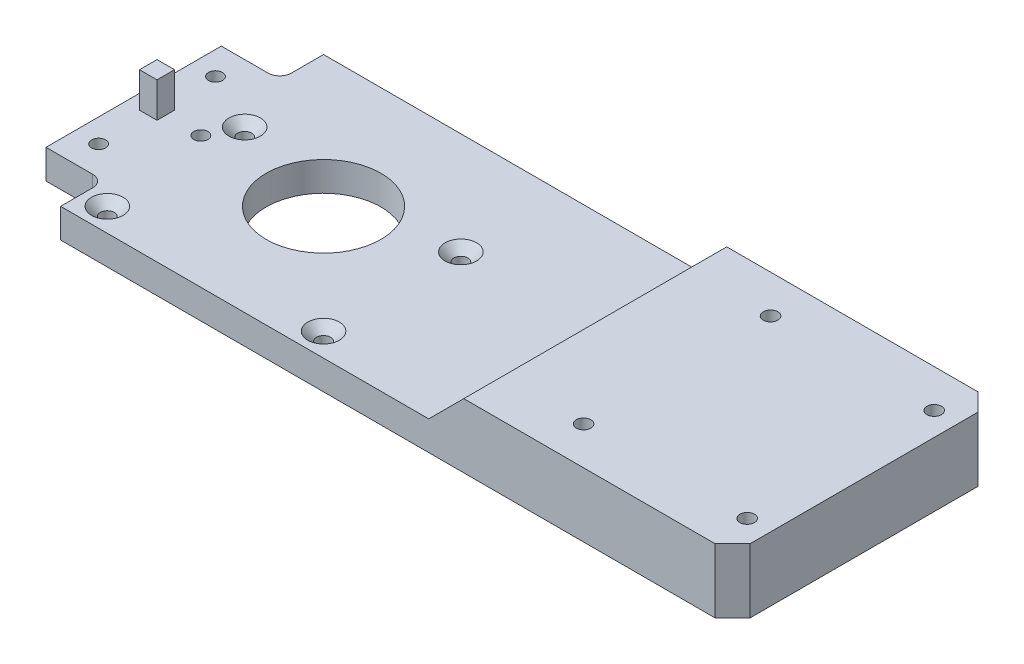
ISO-10303-21;
HEADER;
FILE_DESCRIPTION(('STEP AP214'),'2;1');
FILE_NAME('part.step','',(''),(''),'','','');
FILE_SCHEMA(('AUTOMOTIVE_DESIGN { 1 0 10303 214 1 1 1 1 }'));
ENDSEC;
DATA;
#1=APPLICATION_CONTEXT('core data for automotive mechanical design processes');
#2=APPLICATION_PROTOCOL_DEFINITION('international standard','automotive_design',2000,#1);
#3=PRODUCT_CONTEXT('',#1,'mechanical');
#4=PRODUCT('Part','Part','',(#3));
#5=PRODUCT_RELATED_PRODUCT_CATEGORY('part','',(#4));
#6=PRODUCT_DEFINITION_FORMATION('','',#4);
#7=PRODUCT_DEFINITION_CONTEXT('part definition',#1,'design');
#8=PRODUCT_DEFINITION('design','',#6,#7);
#9=PRODUCT_DEFINITION_SHAPE('','',#8);
#10=(LENGTH_UNIT() NAMED_UNIT(*) SI_UNIT(.MILLI.,.METRE.));
#11=(NAMED_UNIT(*) PLANE_ANGLE_UNIT() SI_UNIT($,.RADIAN.));
#12=(NAMED_UNIT(*) SI_UNIT($,.STERADIAN.) SOLID_ANGLE_UNIT());
#13=UNCERTAINTY_MEASURE_WITH_UNIT(LENGTH_MEASURE(1.E-05),#10,'distance_accuracy_value','');
#14=(GEOMETRIC_REPRESENTATION_CONTEXT(3) GLOBAL_UNCERTAINTY_ASSIGNED_CONTEXT((#13)) GLOBAL_UNIT_ASSIGNED_CONTEXT((#10,
#11,#12)) REPRESENTATION_CONTEXT('',''));
#15=CARTESIAN_POINT('',(0.,0.,0.));
#16=DIRECTION('',(0.,0.,1.));
#17=DIRECTION('',(1.,0.,0.));
#18=AXIS2_PLACEMENT_3D('',#15,#16,#17);
#19=CARTESIAN_POINT('',(0.,5.,0.));
#20=DIRECTION('',(0.,1.,0.));
#21=DIRECTION('',(0.,0.,1.));
#22=AXIS2_PLACEMENT_3D('',#19,#20,#21);
#23=PLANE('',#22);
#24=CARTESIAN_POINT('',(1.5,5.,0.));
#25=DIRECTION('',(0.,-1.,0.));
#26=DIRECTION('',(0.,0.,-1.));
#27=AXIS2_PLACEMENT_3D('',#24,#25,#26);
#28=CIRCLE('',#27,1.19999999999999);
#29=CARTESIAN_POINT('',(1.5,5.,-1.19999999999999));
#30=VERTEX_POINT('',#29);
#31=EDGE_CURVE('E200',#30,#30,#28,.T.);
#32=ORIENTED_EDGE('',*,*,#31,.T.);
#33=EDGE_LOOP('',(#32));
#34=FACE_BOUND('',#33,.T.);
#35=CARTESIAN_POINT('',(-6.,5.,10.));
#36=DIRECTION('',(0.,-1.,0.));
#37=DIRECTION('',(0.,0.,-1.));
#38=AXIS2_PLACEMENT_3D('',#35,#36,#37);
#39=CIRCLE('',#38,1.19999999999999);
#40=CARTESIAN_POINT('',(-6.,5.,8.80000000000001));
#41=VERTEX_POINT('',#40);
#42=EDGE_CURVE('E209',#41,#41,#39,.T.);
#43=ORIENTED_EDGE('',*,*,#42,.T.);
#44=EDGE_LOOP('',(#43));
#45=FACE_BOUND('',#44,.T.);
#46=CARTESIAN_POINT('',(-6.,5.,-10.));
#47=DIRECTION('',(0.,-1.,0.));
#48=DIRECTION('',(0.,0.,-1.));
#49=AXIS2_PLACEMENT_3D('',#46,#47,#48);
#50=CIRCLE('',#49,1.19999999999999);
#51=CARTESIAN_POINT('',(-6.,5.,-11.2));
#52=VERTEX_POINT('',#51);
#53=EDGE_CURVE('E218',#52,#52,#50,.T.);
#54=ORIENTED_EDGE('',*,*,#53,.T.);
#55=EDGE_LOOP('',(#54));
#56=FACE_BOUND('',#55,.T.);
#57=DIRECTION('',(0.,0.,1.));
#58=VECTOR('',#57,1.);
#59=CARTESIAN_POINT('',(63.,5.,-22.5));
#60=LINE('',#59,#58);
#61=CARTESIAN_POINT('',(63.,5.,-22.5));
#62=VERTEX_POINT('',#61);
#63=CARTESIAN_POINT('',(63.,5.,22.5));
#64=VERTEX_POINT('',#63);
#65=EDGE_CURVE('E266',#62,#64,#60,.T.);
#66=ORIENTED_EDGE('',*,*,#65,.F.);
#67=DIRECTION('',(1.,0.,0.));
#68=VECTOR('',#67,1.);
#69=CARTESIAN_POINT('',(0.,5.,-22.5));
#70=LINE('',#69,#68);
#71=CARTESIAN_POINT('',(0.,5.,-22.5));
#72=VERTEX_POINT('',#71);
#73=EDGE_CURVE('E323',#72,#62,#70,.T.);
#74=ORIENTED_EDGE('',*,*,#73,.F.);
#75=DIRECTION('',(0.,0.,-1.));
#76=VECTOR('',#75,1.);
#77=CARTESIAN_POINT('',(0.,5.,22.5));
#78=LINE('',#77,#76);
#79=CARTESIAN_POINT('',(0.,5.,-17.));
#80=VERTEX_POINT('',#79);
#81=EDGE_CURVE('E327',#80,#72,#78,.T.);
#82=ORIENTED_EDGE('',*,*,#81,.F.);
#83=CARTESIAN_POINT('',(-2.,5.,-17.));
#84=DIRECTION('',(0.,1.,0.));
#85=DIRECTION('',(0.,0.,1.));
#86=AXIS2_PLACEMENT_3D('',#83,#84,#85);
#87=CIRCLE('',#86,2.);
#88=CARTESIAN_POINT('',(-2.,5.,-15.));
#89=VERTEX_POINT('',#88);
#90=EDGE_CURVE('E11',#80,#89,#87,.F.);
#91=ORIENTED_EDGE('',*,*,#90,.T.);
#92=DIRECTION('',(-1.,0.,0.));
#93=VECTOR('',#92,1.);
#94=CARTESIAN_POINT('',(-10.,5.,-15.));
#95=LINE('',#94,#93);
#96=CARTESIAN_POINT('',(-10.,5.,-15.));
#97=VERTEX_POINT('',#96);
#98=EDGE_CURVE('E225',#89,#97,#95,.T.);
#99=ORIENTED_EDGE('',*,*,#98,.T.);
#100=DIRECTION('',(0.,0.,1.));
#101=VECTOR('',#100,1.);
#102=CARTESIAN_POINT('',(-10.,5.,15.));
#103=LINE('',#102,#101);
#104=CARTESIAN_POINT('',(-10.,5.,15.));
#105=VERTEX_POINT('',#104);
#106=EDGE_CURVE('E236',#97,#105,#103,.T.);
#107=ORIENTED_EDGE('',*,*,#106,.T.);
#108=DIRECTION('',(1.,0.,0.));
#109=VECTOR('',#108,1.);
#110=CARTESIAN_POINT('',(0.,5.,15.));
#111=LINE('',#110,#109);
#112=CARTESIAN_POINT('',(-2.,5.,15.));
#113=VERTEX_POINT('',#112);
#114=EDGE_CURVE('E232',#105,#113,#111,.T.);
#115=ORIENTED_EDGE('',*,*,#114,.T.);
#116=CARTESIAN_POINT('',(-2.,5.,17.));
#117=DIRECTION('',(0.,1.,0.));
#118=DIRECTION('',(0.,0.,1.));
#119=AXIS2_PLACEMENT_3D('',#116,#117,#118);
#120=CIRCLE('',#119,2.);
#121=CARTESIAN_POINT('',(0.,5.,17.));
#122=VERTEX_POINT('',#121);
#123=EDGE_CURVE('E385',#113,#122,#120,.F.);
#124=ORIENTED_EDGE('',*,*,#123,.T.);
#125=CARTESIAN_POINT('',(0.,5.,22.5));
#126=VERTEX_POINT('',#125);
#127=EDGE_CURVE('E328',#126,#122,#78,.T.);
#128=ORIENTED_EDGE('',*,*,#127,.F.);
#129=DIRECTION('',(1.,0.,0.));
#130=VECTOR('',#129,1.);
#131=CARTESIAN_POINT('',(0.,5.,22.5));
#132=LINE('',#131,#130);
#133=EDGE_CURVE('E320',#126,#64,#132,.T.);
#134=ORIENTED_EDGE('',*,*,#133,.T.);
#135=EDGE_LOOP('',(#66,#74,#82,#91,#99,#107,#115,#124,#128,#134));
#136=FACE_BOUND('',#135,.T.);
#137=CARTESIAN_POINT('',(4.,5.,18.5));
#138=DIRECTION('',(0.,1.,0.));
#139=DIRECTION('',(0.,0.,1.));
#140=AXIS2_PLACEMENT_3D('',#137,#138,#139);
#141=CIRCLE('',#140,2.7);
#142=CARTESIAN_POINT('',(4.,5.,21.2));
#143=VERTEX_POINT('',#142);
#144=EDGE_CURVE('E275',#143,#143,#141,.T.);
#145=ORIENTED_EDGE('',*,*,#144,.F.);
#146=EDGE_LOOP('',(#145));
#147=FACE_BOUND('',#146,.T.);
#148=CARTESIAN_POINT('',(41.,5.,18.5));
#149=DIRECTION('',(0.,1.,0.));
#150=DIRECTION('',(0.,0.,1.));
#151=AXIS2_PLACEMENT_3D('',#148,#149,#150);
#152=CIRCLE('',#151,2.7);
#153=CARTESIAN_POINT('',(41.,5.,21.2));
#154=VERTEX_POINT('',#153);
#155=EDGE_CURVE('E286',#154,#154,#152,.T.);
#156=ORIENTED_EDGE('',*,*,#155,.F.);
#157=EDGE_LOOP('',(#156));
#158=FACE_BOUND('',#157,.T.);
#159=CARTESIAN_POINT('',(41.,5.,-5.));
#160=DIRECTION('',(0.,1.,0.));
#161=DIRECTION('',(0.,0.,1.));
#162=AXIS2_PLACEMENT_3D('',#159,#160,#161);
#163=CIRCLE('',#162,2.7);
#164=CARTESIAN_POINT('',(41.,5.,-2.3));
#165=VERTEX_POINT('',#164);
#166=EDGE_CURVE('E295',#165,#165,#163,.T.);
#167=ORIENTED_EDGE('',*,*,#166,.F.);
#168=EDGE_LOOP('',(#167));
#169=FACE_BOUND('',#168,.T.);
#170=CARTESIAN_POINT('',(4.,5.,-5.));
#171=DIRECTION('',(0.,1.,0.));
#172=DIRECTION('',(0.,0.,1.));
#173=AXIS2_PLACEMENT_3D('',#170,#171,#172);
#174=CIRCLE('',#173,2.7);
#175=CARTESIAN_POINT('',(4.,5.,-2.3));
#176=VERTEX_POINT('',#175);
#177=EDGE_CURVE('E304',#176,#176,#174,.T.);
#178=ORIENTED_EDGE('',*,*,#177,.F.);
#179=EDGE_LOOP('',(#178));
#180=FACE_BOUND('',#179,.T.);
#181=CARTESIAN_POINT('',(22.5,5.,0.));
#182=DIRECTION('',(0.,1.,0.));
#183=DIRECTION('',(0.,0.,1.));
#184=AXIS2_PLACEMENT_3D('',#181,#182,#183);
#185=CIRCLE('',#184,9.81710000000001);
#186=CARTESIAN_POINT('',(22.5,5.,9.81710000000001));
#187=VERTEX_POINT('',#186);
#188=EDGE_CURVE('E313',#187,#187,#185,.T.);
#189=ORIENTED_EDGE('',*,*,#188,.F.);
#190=EDGE_LOOP('',(#189));
#191=FACE_BOUND('',#190,.T.);
#192=DIRECTION('',(0.,0.,1.));
#193=VECTOR('',#192,1.);
#194=CARTESIAN_POINT('',(-7.5,5.,-1.5));
#195=LINE('',#194,#193);
#196=CARTESIAN_POINT('',(-7.5,5.,-1.5));
#197=VERTEX_POINT('',#196);
#198=CARTESIAN_POINT('',(-7.5,5.,1.5));
#199=VERTEX_POINT('',#198);
#200=EDGE_CURVE('E174',#197,#199,#195,.T.);
#201=ORIENTED_EDGE('',*,*,#200,.F.);
#202=DIRECTION('',(-1.,0.,0.));
#203=VECTOR('',#202,1.);
#204=CARTESIAN_POINT('',(-7.5,5.,-1.5));
#205=LINE('',#204,#203);
#206=CARTESIAN_POINT('',(-4.5,5.,-1.5));
#207=VERTEX_POINT('',#206);
#208=EDGE_CURVE('E50',#207,#197,#205,.T.);
#209=ORIENTED_EDGE('',*,*,#208,.F.);
#210=DIRECTION('',(0.,0.,-1.));
#211=VECTOR('',#210,1.);
#212=CARTESIAN_POINT('',(-4.5,5.,-1.5));
#213=LINE('',#212,#211);
#214=CARTESIAN_POINT('',(-4.5,5.,1.5));
#215=VERTEX_POINT('',#214);
#216=EDGE_CURVE('E180',#215,#207,#213,.T.);
#217=ORIENTED_EDGE('',*,*,#216,.F.);
#218=DIRECTION('',(1.,0.,0.));
#219=VECTOR('',#218,1.);
#220=CARTESIAN_POINT('',(-7.5,5.,1.5));
#221=LINE('',#220,#219);
#222=EDGE_CURVE('E165',#199,#215,#221,.T.);
#223=ORIENTED_EDGE('',*,*,#222,.F.);
#224=EDGE_LOOP('',(#201,#209,#217,#223));
#225=FACE_BOUND('',#224,.T.);
#226=ADVANCED_FACE('F35',(#34,#45,#56,#136,#147,#158,#169,#180,#191,#225),#23,.T.);
#227=CARTESIAN_POINT('',(0.,5.,22.5));
#228=DIRECTION('',(-1.,0.,0.));
#229=DIRECTION('',(0.,0.,1.));
#230=AXIS2_PLACEMENT_3D('',#227,#228,#229);
#231=PLANE('',#230);
#232=ORIENTED_EDGE('',*,*,#127,.T.);
#233=DIRECTION('',(0.,-1.,0.));
#234=VECTOR('',#233,1.);
#235=CARTESIAN_POINT('',(0.,5.,17.));
#236=LINE('',#235,#234);
#237=CARTESIAN_POINT('',(0.,0.,17.));
#238=VERTEX_POINT('',#237);
#239=EDGE_CURVE('E373',#122,#238,#236,.T.);
#240=ORIENTED_EDGE('',*,*,#239,.T.);
#241=DIRECTION('',(0.,0.,-1.));
#242=VECTOR('',#241,1.);
#243=CARTESIAN_POINT('',(0.,0.,22.5));
#244=LINE('',#243,#242);
#245=CARTESIAN_POINT('',(0.,0.,22.5));
#246=VERTEX_POINT('',#245);
#247=EDGE_CURVE('E324',#246,#238,#244,.T.);
#248=ORIENTED_EDGE('',*,*,#247,.F.);
#249=DIRECTION('',(0.,-1.,0.));
#250=VECTOR('',#249,1.);
#251=CARTESIAN_POINT('',(0.,5.,22.5));
#252=LINE('',#251,#250);
#253=EDGE_CURVE('E331',#126,#246,#252,.T.);
#254=ORIENTED_EDGE('',*,*,#253,.F.);
#255=EDGE_LOOP('',(#232,#240,#248,#254));
#256=FACE_BOUND('',#255,.T.);
#257=ADVANCED_FACE('F394',(#256),#231,.T.);
#258=CARTESIAN_POINT('',(0.,5.,22.5));
#259=DIRECTION('',(0.,0.,-1.));
#260=DIRECTION('',(-1.,0.,0.));
#261=AXIS2_PLACEMENT_3D('',#258,#259,#260);
#262=PLANE('',#261);
#263=DIRECTION('',(1.,0.,0.));
#264=VECTOR('',#263,1.);
#265=CARTESIAN_POINT('',(0.,0.,22.5));
#266=LINE('',#265,#264);
#267=CARTESIAN_POINT('',(112.,0.,22.5));
#268=VERTEX_POINT('',#267);
#269=EDGE_CURVE('E319',#246,#268,#266,.T.);
#270=ORIENTED_EDGE('',*,*,#269,.T.);
#271=DIRECTION('',(0.,1.,0.));
#272=VECTOR('',#271,1.);
#273=CARTESIAN_POINT('',(112.,5.,22.5));
#274=LINE('',#273,#272);
#275=CARTESIAN_POINT('',(112.,11.,22.5));
#276=VERTEX_POINT('',#275);
#277=EDGE_CURVE('E371',#268,#276,#274,.T.);
#278=ORIENTED_EDGE('',*,*,#277,.T.);
#279=DIRECTION('',(1.,0.,0.));
#280=VECTOR('',#279,1.);
#281=CARTESIAN_POINT('',(115.,11.,22.5));
#282=LINE('',#281,#280);
#283=CARTESIAN_POINT('',(69.,11.,22.5));
#284=VERTEX_POINT('',#283);
#285=EDGE_CURVE('E272',#284,#276,#282,.T.);
#286=ORIENTED_EDGE('',*,*,#285,.F.);
#287=DIRECTION('',(0.707106781186546,0.707106781186549,0.));
#288=VECTOR('',#287,1.);
#289=CARTESIAN_POINT('',(69.,11.,22.5));
#290=LINE('',#289,#288);
#291=EDGE_CURVE('E350',#284,#64,#290,.F.);
#292=ORIENTED_EDGE('',*,*,#291,.T.);
#293=ORIENTED_EDGE('',*,*,#133,.F.);
#294=ORIENTED_EDGE('',*,*,#253,.T.);
#295=EDGE_LOOP('',(#270,#278,#286,#292,#293,#294));
#296=FACE_BOUND('',#295,.T.);
#297=ADVANCED_FACE('F434',(#296),#262,.F.);
#298=CARTESIAN_POINT('',(115.,5.,22.5));
#299=DIRECTION('',(-1.,0.,0.));
#300=DIRECTION('',(0.,0.,1.));
#301=AXIS2_PLACEMENT_3D('',#298,#299,#300);
#302=PLANE('',#301);
#303=DIRECTION('',(0.,0.,-1.));
#304=VECTOR('',#303,1.);
#305=CARTESIAN_POINT('',(115.,0.,22.5));
#306=LINE('',#305,#304);
#307=CARTESIAN_POINT('',(115.,0.,19.5));
#308=VERTEX_POINT('',#307);
#309=CARTESIAN_POINT('',(115.,0.,-19.5));
#310=VERTEX_POINT('',#309);
#311=EDGE_CURVE('E334',#308,#310,#306,.T.);
#312=ORIENTED_EDGE('',*,*,#311,.T.);
#313=DIRECTION('',(0.,1.,0.));
#314=VECTOR('',#313,1.);
#315=CARTESIAN_POINT('',(115.,11.,-19.5));
#316=LINE('',#315,#314);
#317=CARTESIAN_POINT('',(115.,11.,-19.5));
#318=VERTEX_POINT('',#317);
#319=EDGE_CURVE('E365',#310,#318,#316,.T.);
#320=ORIENTED_EDGE('',*,*,#319,.T.);
#321=DIRECTION('',(0.,0.,-1.));
#322=VECTOR('',#321,1.);
#323=CARTESIAN_POINT('',(115.,11.,-22.5));
#324=LINE('',#323,#322);
#325=CARTESIAN_POINT('',(115.,11.,19.5));
#326=VERTEX_POINT('',#325);
#327=EDGE_CURVE('E267',#326,#318,#324,.T.);
#328=ORIENTED_EDGE('',*,*,#327,.F.);
#329=DIRECTION('',(0.,-1.,0.));
#330=VECTOR('',#329,1.);
#331=CARTESIAN_POINT('',(115.,5.,19.5));
#332=LINE('',#331,#330);
#333=EDGE_CURVE('E362',#326,#308,#332,.T.);
#334=ORIENTED_EDGE('',*,*,#333,.T.);
#335=EDGE_LOOP('',(#312,#320,#328,#334));
#336=FACE_BOUND('',#335,.T.);
#337=ADVANCED_FACE('F442',(#336),#302,.F.);
#338=CARTESIAN_POINT('',(0.,5.,-22.5));
#339=DIRECTION('',(0.,0.,-1.));
#340=DIRECTION('',(-1.,0.,0.));
#341=AXIS2_PLACEMENT_3D('',#338,#339,#340);
#342=PLANE('',#341);
#343=DIRECTION('',(-1.,0.,0.));
#344=VECTOR('',#343,1.);
#345=CARTESIAN_POINT('',(115.,11.,-22.5));
#346=LINE('',#345,#344);
#347=CARTESIAN_POINT('',(112.,11.,-22.5));
#348=VERTEX_POINT('',#347);
#349=CARTESIAN_POINT('',(69.,11.,-22.5));
#350=VERTEX_POINT('',#349);
#351=EDGE_CURVE('E270',#348,#350,#346,.T.);
#352=ORIENTED_EDGE('',*,*,#351,.F.);
#353=DIRECTION('',(0.,-1.,0.));
#354=VECTOR('',#353,1.);
#355=CARTESIAN_POINT('',(112.,0.,-22.5));
#356=LINE('',#355,#354);
#357=CARTESIAN_POINT('',(112.,0.,-22.5));
#358=VERTEX_POINT('',#357);
#359=EDGE_CURVE('E355',#348,#358,#356,.T.);
#360=ORIENTED_EDGE('',*,*,#359,.T.);
#361=DIRECTION('',(1.,0.,0.));
#362=VECTOR('',#361,1.);
#363=CARTESIAN_POINT('',(0.,0.,-22.5));
#364=LINE('',#363,#362);
#365=CARTESIAN_POINT('',(0.,0.,-22.5));
#366=VERTEX_POINT('',#365);
#367=EDGE_CURVE('E337',#366,#358,#364,.T.);
#368=ORIENTED_EDGE('',*,*,#367,.F.);
#369=DIRECTION('',(0.,-1.,0.));
#370=VECTOR('',#369,1.);
#371=CARTESIAN_POINT('',(0.,5.,-22.5));
#372=LINE('',#371,#370);
#373=EDGE_CURVE('E344',#72,#366,#372,.T.);
#374=ORIENTED_EDGE('',*,*,#373,.F.);
#375=ORIENTED_EDGE('',*,*,#73,.T.);
#376=DIRECTION('',(-0.707106781186546,-0.707106781186549,0.));
#377=VECTOR('',#376,1.);
#378=CARTESIAN_POINT('',(31.5000000000002,-26.5,-22.5));
#379=LINE('',#378,#377);
#380=EDGE_CURVE('E352',#62,#350,#379,.F.);
#381=ORIENTED_EDGE('',*,*,#380,.T.);
#382=EDGE_LOOP('',(#352,#360,#368,#374,#375,#381));
#383=FACE_BOUND('',#382,.T.);
#384=ADVANCED_FACE('F424',(#383),#342,.T.);
#385=CARTESIAN_POINT('',(0.,0.,-17.));
#386=VERTEX_POINT('',#385);
#387=EDGE_CURVE('E340',#386,#366,#244,.T.);
#388=ORIENTED_EDGE('',*,*,#387,.F.);
#389=DIRECTION('',(0.,-1.,0.));
#390=VECTOR('',#389,1.);
#391=CARTESIAN_POINT('',(0.,5.,-17.));
#392=LINE('',#391,#390);
#393=EDGE_CURVE('E381',#386,#80,#392,.F.);
#394=ORIENTED_EDGE('',*,*,#393,.T.);
#395=ORIENTED_EDGE('',*,*,#81,.T.);
#396=ORIENTED_EDGE('',*,*,#373,.T.);
#397=EDGE_LOOP('',(#388,#394,#395,#396));
#398=FACE_BOUND('',#397,.T.);
#399=ADVANCED_FACE('F418',(#398),#231,.T.);
#400=CARTESIAN_POINT('',(0.,0.,0.));
#401=DIRECTION('',(0.,1.,0.));
#402=DIRECTION('',(0.,0.,1.));
#403=AXIS2_PLACEMENT_3D('',#400,#401,#402);
#404=PLANE('',#403);
#405=CARTESIAN_POINT('',(1.5,0.,0.));
#406=DIRECTION('',(0.,-1.,0.));
#407=DIRECTION('',(0.,0.,-1.));
#408=AXIS2_PLACEMENT_3D('',#405,#406,#407);
#409=CIRCLE('',#408,2.7);
#410=CARTESIAN_POINT('',(1.5,0.,-2.7));
#411=VERTEX_POINT('',#410);
#412=EDGE_CURVE('E193',#411,#411,#409,.T.);
#413=ORIENTED_EDGE('',*,*,#412,.F.);
#414=EDGE_LOOP('',(#413));
#415=FACE_BOUND('',#414,.T.);
#416=CARTESIAN_POINT('',(-6.,0.,10.));
#417=DIRECTION('',(0.,-1.,0.));
#418=DIRECTION('',(0.,0.,-1.));
#419=AXIS2_PLACEMENT_3D('',#416,#417,#418);
#420=CIRCLE('',#419,2.7);
#421=CARTESIAN_POINT('',(-6.,0.,7.3));
#422=VERTEX_POINT('',#421);
#423=EDGE_CURVE('E203',#422,#422,#420,.T.);
#424=ORIENTED_EDGE('',*,*,#423,.F.);
#425=EDGE_LOOP('',(#424));
#426=FACE_BOUND('',#425,.T.);
#427=CARTESIAN_POINT('',(-6.,0.,-10.));
#428=DIRECTION('',(0.,-1.,0.));
#429=DIRECTION('',(0.,0.,-1.));
#430=AXIS2_PLACEMENT_3D('',#427,#428,#429);
#431=CIRCLE('',#430,2.7);
#432=CARTESIAN_POINT('',(-6.,0.,-12.7));
#433=VERTEX_POINT('',#432);
#434=EDGE_CURVE('E212',#433,#433,#431,.T.);
#435=ORIENTED_EDGE('',*,*,#434,.F.);
#436=EDGE_LOOP('',(#435));
#437=FACE_BOUND('',#436,.T.);
#438=CARTESIAN_POINT('',(83.,0.,-16.));
#439=DIRECTION('',(0.,1.,0.));
#440=DIRECTION('',(0.,0.,1.));
#441=AXIS2_PLACEMENT_3D('',#438,#439,#440);
#442=CIRCLE('',#441,1.25);
#443=CARTESIAN_POINT('',(83.,0.,-14.75));
#444=VERTEX_POINT('',#443);
#445=EDGE_CURVE('E245',#444,#444,#442,.T.);
#446=ORIENTED_EDGE('',*,*,#445,.T.);
#447=EDGE_LOOP('',(#446));
#448=FACE_BOUND('',#447,.T.);
#449=CARTESIAN_POINT('',(111.,0.,-16.));
#450=DIRECTION('',(0.,1.,0.));
#451=DIRECTION('',(0.,0.,1.));
#452=AXIS2_PLACEMENT_3D('',#449,#450,#451);
#453=CIRCLE('',#452,1.25);
#454=CARTESIAN_POINT('',(111.,0.,-14.75));
#455=VERTEX_POINT('',#454);
#456=EDGE_CURVE('E251',#455,#455,#453,.T.);
#457=ORIENTED_EDGE('',*,*,#456,.T.);
#458=EDGE_LOOP('',(#457));
#459=FACE_BOUND('',#458,.T.);
#460=CARTESIAN_POINT('',(83.,0.,16.));
#461=DIRECTION('',(0.,1.,0.));
#462=DIRECTION('',(0.,0.,1.));
#463=AXIS2_PLACEMENT_3D('',#460,#461,#462);
#464=CIRCLE('',#463,1.25);
#465=CARTESIAN_POINT('',(83.,0.,17.25));
#466=VERTEX_POINT('',#465);
#467=EDGE_CURVE('E257',#466,#466,#464,.T.);
#468=ORIENTED_EDGE('',*,*,#467,.T.);
#469=EDGE_LOOP('',(#468));
#470=FACE_BOUND('',#469,.T.);
#471=CARTESIAN_POINT('',(111.,0.,16.));
#472=DIRECTION('',(0.,1.,0.));
#473=DIRECTION('',(0.,0.,1.));
#474=AXIS2_PLACEMENT_3D('',#471,#472,#473);
#475=CIRCLE('',#474,1.25);
#476=CARTESIAN_POINT('',(111.,0.,17.25));
#477=VERTEX_POINT('',#476);
#478=EDGE_CURVE('E263',#477,#477,#475,.T.);
#479=ORIENTED_EDGE('',*,*,#478,.T.);
#480=EDGE_LOOP('',(#479));
#481=FACE_BOUND('',#480,.T.);
#482=CARTESIAN_POINT('',(4.,0.,18.5));
#483=DIRECTION('',(0.,1.,0.));
#484=DIRECTION('',(0.,0.,1.));
#485=AXIS2_PLACEMENT_3D('',#482,#483,#484);
#486=CIRCLE('',#485,1.19999999999999);
#487=CARTESIAN_POINT('',(4.,0.,19.7));
#488=VERTEX_POINT('',#487);
#489=EDGE_CURVE('E283',#488,#488,#486,.T.);
#490=ORIENTED_EDGE('',*,*,#489,.T.);
#491=EDGE_LOOP('',(#490));
#492=FACE_BOUND('',#491,.T.);
#493=CARTESIAN_POINT('',(41.,0.,18.5));
#494=DIRECTION('',(0.,1.,0.));
#495=DIRECTION('',(0.,0.,1.));
#496=AXIS2_PLACEMENT_3D('',#493,#494,#495);
#497=CIRCLE('',#496,1.19999999999999);
#498=CARTESIAN_POINT('',(41.,0.,19.7));
#499=VERTEX_POINT('',#498);
#500=EDGE_CURVE('E292',#499,#499,#497,.T.);
#501=ORIENTED_EDGE('',*,*,#500,.T.);
#502=EDGE_LOOP('',(#501));
#503=FACE_BOUND('',#502,.T.);
#504=CARTESIAN_POINT('',(41.,0.,-5.));
#505=DIRECTION('',(0.,1.,0.));
#506=DIRECTION('',(0.,0.,1.));
#507=AXIS2_PLACEMENT_3D('',#504,#505,#506);
#508=CIRCLE('',#507,1.19999999999999);
#509=CARTESIAN_POINT('',(41.,0.,-3.80000000000002));
#510=VERTEX_POINT('',#509);
#511=EDGE_CURVE('E301',#510,#510,#508,.T.);
#512=ORIENTED_EDGE('',*,*,#511,.T.);
#513=EDGE_LOOP('',(#512));
#514=FACE_BOUND('',#513,.T.);
#515=CARTESIAN_POINT('',(4.,0.,-5.));
#516=DIRECTION('',(0.,1.,0.));
#517=DIRECTION('',(0.,0.,1.));
#518=AXIS2_PLACEMENT_3D('',#515,#516,#517);
#519=CIRCLE('',#518,1.19999999999999);
#520=CARTESIAN_POINT('',(4.,0.,-3.80000000000001));
#521=VERTEX_POINT('',#520);
#522=EDGE_CURVE('E310',#521,#521,#519,.T.);
#523=ORIENTED_EDGE('',*,*,#522,.T.);
#524=EDGE_LOOP('',(#523));
#525=FACE_BOUND('',#524,.T.);
#526=CARTESIAN_POINT('',(22.5,0.,0.));
#527=DIRECTION('',(0.,1.,0.));
#528=DIRECTION('',(0.,0.,1.));
#529=AXIS2_PLACEMENT_3D('',#526,#527,#528);
#530=CIRCLE('',#529,9.81710000000001);
#531=CARTESIAN_POINT('',(22.5,0.,9.81710000000001));
#532=VERTEX_POINT('',#531);
#533=EDGE_CURVE('E316',#532,#532,#530,.F.);
#534=ORIENTED_EDGE('',*,*,#533,.F.);
#535=EDGE_LOOP('',(#534));
#536=FACE_BOUND('',#535,.T.);
#537=ORIENTED_EDGE('',*,*,#367,.T.);
#538=DIRECTION('',(0.707106781186546,0.,0.707106781186549));
#539=VECTOR('',#538,1.);
#540=CARTESIAN_POINT('',(112.,0.,-22.5));
#541=LINE('',#540,#539);
#542=EDGE_CURVE('E360',#358,#310,#541,.T.);
#543=ORIENTED_EDGE('',*,*,#542,.T.);
#544=ORIENTED_EDGE('',*,*,#311,.F.);
#545=DIRECTION('',(0.707106781186549,0.,-0.707106781186546));
#546=VECTOR('',#545,1.);
#547=CARTESIAN_POINT('',(115.,0.,19.5));
#548=LINE('',#547,#546);
#549=EDGE_CURVE('E358',#308,#268,#548,.F.);
#550=ORIENTED_EDGE('',*,*,#549,.T.);
#551=ORIENTED_EDGE('',*,*,#269,.F.);
#552=ORIENTED_EDGE('',*,*,#247,.T.);
#553=CARTESIAN_POINT('',(-2.,0.,17.));
#554=DIRECTION('',(0.,1.,0.));
#555=DIRECTION('',(0.,0.,1.));
#556=AXIS2_PLACEMENT_3D('',#553,#554,#555);
#557=CIRCLE('',#556,2.);
#558=CARTESIAN_POINT('',(-2.,0.,15.));
#559=VERTEX_POINT('',#558);
#560=EDGE_CURVE('E383',#238,#559,#557,.T.);
#561=ORIENTED_EDGE('',*,*,#560,.T.);
#562=DIRECTION('',(1.,0.,0.));
#563=VECTOR('',#562,1.);
#564=CARTESIAN_POINT('',(0.,0.,15.));
#565=LINE('',#564,#563);
#566=CARTESIAN_POINT('',(-10.,0.,15.));
#567=VERTEX_POINT('',#566);
#568=EDGE_CURVE('E222',#567,#559,#565,.T.);
#569=ORIENTED_EDGE('',*,*,#568,.F.);
#570=DIRECTION('',(0.,0.,1.));
#571=VECTOR('',#570,1.);
#572=CARTESIAN_POINT('',(-10.,0.,15.));
#573=LINE('',#572,#571);
#574=CARTESIAN_POINT('',(-10.,0.,-15.));
#575=VERTEX_POINT('',#574);
#576=EDGE_CURVE('E227',#575,#567,#573,.T.);
#577=ORIENTED_EDGE('',*,*,#576,.F.);
#578=DIRECTION('',(-1.,0.,0.));
#579=VECTOR('',#578,1.);
#580=CARTESIAN_POINT('',(-10.,0.,-15.));
#581=LINE('',#580,#579);
#582=CARTESIAN_POINT('',(-2.,0.,-15.));
#583=VERTEX_POINT('',#582);
#584=EDGE_CURVE('E221',#583,#575,#581,.T.);
#585=ORIENTED_EDGE('',*,*,#584,.F.);
#586=CARTESIAN_POINT('',(-2.,0.,-17.));
#587=DIRECTION('',(0.,1.,0.));
#588=DIRECTION('',(0.,0.,1.));
#589=AXIS2_PLACEMENT_3D('',#586,#587,#588);
#590=CIRCLE('',#589,2.);
#591=EDGE_CURVE('E43',#583,#386,#590,.T.);
#592=ORIENTED_EDGE('',*,*,#591,.T.);
#593=ORIENTED_EDGE('',*,*,#387,.T.);
#594=EDGE_LOOP('',(#537,#543,#544,#550,#551,#552,#561,#569,#577,#585,#592,#593));
#595=FACE_BOUND('',#594,.T.);
#596=ADVANCED_FACE('F399',(#415,#426,#437,#448,#459,#470,#481,#492,#503,#514,#525,#536,#595),
#404,.F.);
#597=CARTESIAN_POINT('',(22.5,-0.00100000000000013,0.));
#598=DIRECTION('',(0.,1.,0.));
#599=DIRECTION('',(0.,0.,1.));
#600=AXIS2_PLACEMENT_3D('',#597,#598,#599);
#601=CYLINDRICAL_SURFACE('',#600,9.81710000000001);
#602=ORIENTED_EDGE('',*,*,#188,.T.);
#603=EDGE_LOOP('',(#602));
#604=FACE_BOUND('',#603,.T.);
#605=ORIENTED_EDGE('',*,*,#533,.T.);
#606=EDGE_LOOP('',(#605));
#607=FACE_BOUND('',#606,.T.);
#608=ADVANCED_FACE('F470',(#604,#607),#601,.F.);
#609=CARTESIAN_POINT('',(4.,5.,-5.));
#610=DIRECTION('',(0.,1.,0.));
#611=DIRECTION('',(0.,0.,1.));
#612=AXIS2_PLACEMENT_3D('',#609,#610,#611);
#613=CYLINDRICAL_SURFACE('',#612,1.19999999999999);
#614=ORIENTED_EDGE('',*,*,#522,.F.);
#615=EDGE_LOOP('',(#614));
#616=FACE_BOUND('',#615,.T.);
#617=CARTESIAN_POINT('',(4.,3.5,-5.));
#618=DIRECTION('',(0.,1.,0.));
#619=DIRECTION('',(0.,0.,1.));
#620=AXIS2_PLACEMENT_3D('',#617,#618,#619);
#621=CIRCLE('',#620,1.2);
#622=CARTESIAN_POINT('',(4.,3.5,-3.8));
#623=VERTEX_POINT('',#622);
#624=EDGE_CURVE('E307',#623,#623,#621,.T.);
#625=ORIENTED_EDGE('',*,*,#624,.T.);
#626=EDGE_LOOP('',(#625));
#627=FACE_BOUND('',#626,.T.);
#628=ADVANCED_FACE('F524',(#616,#627),#613,.F.);
#629=CARTESIAN_POINT('',(4.,5.,-5.));
#630=DIRECTION('',(0.,1.,0.));
#631=DIRECTION('',(0.,0.,1.));
#632=AXIS2_PLACEMENT_3D('',#629,#630,#631);
#633=CONICAL_SURFACE('',#632,2.7,0.785398163397448);
#634=ORIENTED_EDGE('',*,*,#624,.F.);
#635=EDGE_LOOP('',(#634));
#636=FACE_BOUND('',#635,.T.);
#637=ORIENTED_EDGE('',*,*,#177,.T.);
#638=EDGE_LOOP('',(#637));
#639=FACE_BOUND('',#638,.T.);
#640=ADVANCED_FACE('F521',(#636,#639),#633,.F.);
#641=CARTESIAN_POINT('',(41.,5.,-5.));
#642=DIRECTION('',(0.,1.,0.));
#643=DIRECTION('',(0.,0.,1.));
#644=AXIS2_PLACEMENT_3D('',#641,#642,#643);
#645=CYLINDRICAL_SURFACE('',#644,1.19999999999999);
#646=ORIENTED_EDGE('',*,*,#511,.F.);
#647=EDGE_LOOP('',(#646));
#648=FACE_BOUND('',#647,.T.);
#649=CARTESIAN_POINT('',(41.,3.5,-5.));
#650=DIRECTION('',(0.,1.,0.));
#651=DIRECTION('',(0.,0.,1.));
#652=AXIS2_PLACEMENT_3D('',#649,#650,#651);
#653=CIRCLE('',#652,1.2);
#654=CARTESIAN_POINT('',(41.,3.5,-3.8));
#655=VERTEX_POINT('',#654);
#656=EDGE_CURVE('E298',#655,#655,#653,.T.);
#657=ORIENTED_EDGE('',*,*,#656,.T.);
#658=EDGE_LOOP('',(#657));
#659=FACE_BOUND('',#658,.T.);
#660=ADVANCED_FACE('F517',(#648,#659),#645,.F.);
#661=CARTESIAN_POINT('',(41.,5.,-5.));
#662=DIRECTION('',(0.,1.,0.));
#663=DIRECTION('',(0.,0.,1.));
#664=AXIS2_PLACEMENT_3D('',#661,#662,#663);
#665=CONICAL_SURFACE('',#664,2.7,0.785398163397448);
#666=ORIENTED_EDGE('',*,*,#656,.F.);
#667=EDGE_LOOP('',(#666));
#668=FACE_BOUND('',#667,.T.);
#669=ORIENTED_EDGE('',*,*,#166,.T.);
#670=EDGE_LOOP('',(#669));
#671=FACE_BOUND('',#670,.T.);
#672=ADVANCED_FACE('F513',(#668,#671),#665,.F.);
#673=CARTESIAN_POINT('',(41.,5.,18.5));
#674=DIRECTION('',(0.,1.,0.));
#675=DIRECTION('',(0.,0.,1.));
#676=AXIS2_PLACEMENT_3D('',#673,#674,#675);
#677=CYLINDRICAL_SURFACE('',#676,1.19999999999999);
#678=ORIENTED_EDGE('',*,*,#500,.F.);
#679=EDGE_LOOP('',(#678));
#680=FACE_BOUND('',#679,.T.);
#681=CARTESIAN_POINT('',(41.,3.5,18.5));
#682=DIRECTION('',(0.,1.,0.));
#683=DIRECTION('',(0.,0.,1.));
#684=AXIS2_PLACEMENT_3D('',#681,#682,#683);
#685=CIRCLE('',#684,1.2);
#686=CARTESIAN_POINT('',(41.,3.5,19.7));
#687=VERTEX_POINT('',#686);
#688=EDGE_CURVE('E289',#687,#687,#685,.T.);
#689=ORIENTED_EDGE('',*,*,#688,.T.);
#690=EDGE_LOOP('',(#689));
#691=FACE_BOUND('',#690,.T.);
#692=ADVANCED_FACE('F509',(#680,#691),#677,.F.);
#693=CARTESIAN_POINT('',(41.,5.,18.5));
#694=DIRECTION('',(0.,1.,0.));
#695=DIRECTION('',(0.,0.,1.));
#696=AXIS2_PLACEMENT_3D('',#693,#694,#695);
#697=CONICAL_SURFACE('',#696,2.7,0.785398163397448);
#698=ORIENTED_EDGE('',*,*,#688,.F.);
#699=EDGE_LOOP('',(#698));
#700=FACE_BOUND('',#699,.T.);
#701=ORIENTED_EDGE('',*,*,#155,.T.);
#702=EDGE_LOOP('',(#701));
#703=FACE_BOUND('',#702,.T.);
#704=ADVANCED_FACE('F505',(#700,#703),#697,.F.);
#705=CARTESIAN_POINT('',(4.,5.,18.5));
#706=DIRECTION('',(0.,1.,0.));
#707=DIRECTION('',(0.,0.,1.));
#708=AXIS2_PLACEMENT_3D('',#705,#706,#707);
#709=CYLINDRICAL_SURFACE('',#708,1.19999999999999);
#710=ORIENTED_EDGE('',*,*,#489,.F.);
#711=EDGE_LOOP('',(#710));
#712=FACE_BOUND('',#711,.T.);
#713=CARTESIAN_POINT('',(4.,3.5,18.5));
#714=DIRECTION('',(0.,1.,0.));
#715=DIRECTION('',(0.,0.,1.));
#716=AXIS2_PLACEMENT_3D('',#713,#714,#715);
#717=CIRCLE('',#716,1.2);
#718=CARTESIAN_POINT('',(4.,3.5,19.7));
#719=VERTEX_POINT('',#718);
#720=EDGE_CURVE('E280',#719,#719,#717,.T.);
#721=ORIENTED_EDGE('',*,*,#720,.T.);
#722=EDGE_LOOP('',(#721));
#723=FACE_BOUND('',#722,.T.);
#724=ADVANCED_FACE('F496',(#712,#723),#709,.F.);
#725=CARTESIAN_POINT('',(4.,5.,18.5));
#726=DIRECTION('',(0.,1.,0.));
#727=DIRECTION('',(0.,0.,1.));
#728=AXIS2_PLACEMENT_3D('',#725,#726,#727);
#729=CONICAL_SURFACE('',#728,2.7,0.785398163397448);
#730=ORIENTED_EDGE('',*,*,#720,.F.);
#731=EDGE_LOOP('',(#730));
#732=FACE_BOUND('',#731,.T.);
#733=ORIENTED_EDGE('',*,*,#144,.T.);
#734=EDGE_LOOP('',(#733));
#735=FACE_BOUND('',#734,.T.);
#736=ADVANCED_FACE('F490',(#732,#735),#729,.F.);
#737=CARTESIAN_POINT('',(0.,11.,0.));
#738=DIRECTION('',(0.,-1.,0.));
#739=DIRECTION('',(0.,0.,-1.));
#740=AXIS2_PLACEMENT_3D('',#737,#738,#739);
#741=PLANE('',#740);
#742=CARTESIAN_POINT('',(83.,11.,-16.));
#743=DIRECTION('',(0.,1.,0.));
#744=DIRECTION('',(0.,0.,1.));
#745=AXIS2_PLACEMENT_3D('',#742,#743,#744);
#746=CIRCLE('',#745,1.24999999999999);
#747=CARTESIAN_POINT('',(83.,11.,-14.75));
#748=VERTEX_POINT('',#747);
#749=EDGE_CURVE('E235',#748,#748,#746,.T.);
#750=ORIENTED_EDGE('',*,*,#749,.F.);
#751=EDGE_LOOP('',(#750));
#752=FACE_BOUND('',#751,.T.);
#753=CARTESIAN_POINT('',(111.,11.,-16.));
#754=DIRECTION('',(0.,1.,0.));
#755=DIRECTION('',(0.,0.,1.));
#756=AXIS2_PLACEMENT_3D('',#753,#754,#755);
#757=CIRCLE('',#756,1.24999999999999);
#758=CARTESIAN_POINT('',(111.,11.,-14.75));
#759=VERTEX_POINT('',#758);
#760=EDGE_CURVE('E248',#759,#759,#757,.T.);
#761=ORIENTED_EDGE('',*,*,#760,.F.);
#762=EDGE_LOOP('',(#761));
#763=FACE_BOUND('',#762,.T.);
#764=CARTESIAN_POINT('',(83.,11.,16.));
#765=DIRECTION('',(0.,1.,0.));
#766=DIRECTION('',(0.,0.,1.));
#767=AXIS2_PLACEMENT_3D('',#764,#765,#766);
#768=CIRCLE('',#767,1.24999999999999);
#769=CARTESIAN_POINT('',(83.,11.,17.25));
#770=VERTEX_POINT('',#769);
#771=EDGE_CURVE('E254',#770,#770,#768,.T.);
#772=ORIENTED_EDGE('',*,*,#771,.F.);
#773=EDGE_LOOP('',(#772));
#774=FACE_BOUND('',#773,.T.);
#775=CARTESIAN_POINT('',(111.,11.,16.));
#776=DIRECTION('',(0.,1.,0.));
#777=DIRECTION('',(0.,0.,1.));
#778=AXIS2_PLACEMENT_3D('',#775,#776,#777);
#779=CIRCLE('',#778,1.24999999999999);
#780=CARTESIAN_POINT('',(111.,11.,17.25));
#781=VERTEX_POINT('',#780);
#782=EDGE_CURVE('E260',#781,#781,#779,.T.);
#783=ORIENTED_EDGE('',*,*,#782,.F.);
#784=EDGE_LOOP('',(#783));
#785=FACE_BOUND('',#784,.T.);
#786=ORIENTED_EDGE('',*,*,#327,.T.);
#787=DIRECTION('',(-0.707106781186546,0.,-0.707106781186549));
#788=VECTOR('',#787,1.);
#789=CARTESIAN_POINT('',(112.,11.,-22.5));
#790=LINE('',#789,#788);
#791=EDGE_CURVE('E369',#318,#348,#790,.T.);
#792=ORIENTED_EDGE('',*,*,#791,.T.);
#793=ORIENTED_EDGE('',*,*,#351,.T.);
#794=DIRECTION('',(0.,0.,1.));
#795=VECTOR('',#794,1.);
#796=CARTESIAN_POINT('',(69.,11.,0.));
#797=LINE('',#796,#795);
#798=EDGE_CURVE('E347',#350,#284,#797,.T.);
#799=ORIENTED_EDGE('',*,*,#798,.T.);
#800=ORIENTED_EDGE('',*,*,#285,.T.);
#801=DIRECTION('',(-0.707106781186549,0.,0.707106781186546));
#802=VECTOR('',#801,1.);
#803=CARTESIAN_POINT('',(115.,11.,19.5));
#804=LINE('',#803,#802);
#805=EDGE_CURVE('E367',#276,#326,#804,.F.);
#806=ORIENTED_EDGE('',*,*,#805,.T.);
#807=EDGE_LOOP('',(#786,#792,#793,#799,#800,#806));
#808=FACE_BOUND('',#807,.T.);
#809=ADVANCED_FACE('F431',(#752,#763,#774,#785,#808),#741,.F.);
#810=CARTESIAN_POINT('',(69.,11.,0.));
#811=DIRECTION('',(0.707106781186549,-0.707106781186546,0.));
#812=DIRECTION('',(0.,0.,1.));
#813=AXIS2_PLACEMENT_3D('',#810,#811,#812);
#814=PLANE('',#813);
#815=ORIENTED_EDGE('',*,*,#380,.F.);
#816=ORIENTED_EDGE('',*,*,#65,.T.);
#817=ORIENTED_EDGE('',*,*,#291,.F.);
#818=ORIENTED_EDGE('',*,*,#798,.F.);
#819=EDGE_LOOP('',(#815,#816,#817,#818));
#820=FACE_BOUND('',#819,.T.);
#821=ADVANCED_FACE('F428',(#820),#814,.F.);
#822=CARTESIAN_POINT('',(111.,11.,16.));
#823=DIRECTION('',(0.,1.,0.));
#824=DIRECTION('',(0.,0.,1.));
#825=AXIS2_PLACEMENT_3D('',#822,#823,#824);
#826=CYLINDRICAL_SURFACE('',#825,1.24999999999999);
#827=ORIENTED_EDGE('',*,*,#478,.F.);
#828=EDGE_LOOP('',(#827));
#829=FACE_BOUND('',#828,.T.);
#830=ORIENTED_EDGE('',*,*,#782,.T.);
#831=EDGE_LOOP('',(#830));
#832=FACE_BOUND('',#831,.T.);
#833=ADVANCED_FACE('F482',(#829,#832),#826,.F.);
#834=CARTESIAN_POINT('',(83.,11.,16.));
#835=DIRECTION('',(0.,1.,0.));
#836=DIRECTION('',(0.,0.,1.));
#837=AXIS2_PLACEMENT_3D('',#834,#835,#836);
#838=CYLINDRICAL_SURFACE('',#837,1.24999999999999);
#839=ORIENTED_EDGE('',*,*,#467,.F.);
#840=EDGE_LOOP('',(#839));
#841=FACE_BOUND('',#840,.T.);
#842=ORIENTED_EDGE('',*,*,#771,.T.);
#843=EDGE_LOOP('',(#842));
#844=FACE_BOUND('',#843,.T.);
#845=ADVANCED_FACE('F487',(#841,#844),#838,.F.);
#846=CARTESIAN_POINT('',(111.,11.,-16.));
#847=DIRECTION('',(0.,1.,0.));
#848=DIRECTION('',(0.,0.,1.));
#849=AXIS2_PLACEMENT_3D('',#846,#847,#848);
#850=CYLINDRICAL_SURFACE('',#849,1.24999999999999);
#851=ORIENTED_EDGE('',*,*,#456,.F.);
#852=EDGE_LOOP('',(#851));
#853=FACE_BOUND('',#852,.T.);
#854=ORIENTED_EDGE('',*,*,#760,.T.);
#855=EDGE_LOOP('',(#854));
#856=FACE_BOUND('',#855,.T.);
#857=ADVANCED_FACE('F456',(#853,#856),#850,.F.);
#858=CARTESIAN_POINT('',(83.,11.,-16.));
#859=DIRECTION('',(0.,1.,0.));
#860=DIRECTION('',(0.,0.,1.));
#861=AXIS2_PLACEMENT_3D('',#858,#859,#860);
#862=CYLINDRICAL_SURFACE('',#861,1.24999999999999);
#863=ORIENTED_EDGE('',*,*,#445,.F.);
#864=EDGE_LOOP('',(#863));
#865=FACE_BOUND('',#864,.T.);
#866=ORIENTED_EDGE('',*,*,#749,.T.);
#867=EDGE_LOOP('',(#866));
#868=FACE_BOUND('',#867,.T.);
#869=ADVANCED_FACE('F449',(#865,#868),#862,.F.);
#870=CARTESIAN_POINT('',(112.,5.,-22.5));
#871=DIRECTION('',(0.707106781186549,0.,-0.707106781186546));
#872=DIRECTION('',(0.,1.,0.));
#873=AXIS2_PLACEMENT_3D('',#870,#871,#872);
#874=PLANE('',#873);
#875=ORIENTED_EDGE('',*,*,#791,.F.);
#876=ORIENTED_EDGE('',*,*,#319,.F.);
#877=ORIENTED_EDGE('',*,*,#542,.F.);
#878=ORIENTED_EDGE('',*,*,#359,.F.);
#879=EDGE_LOOP('',(#875,#876,#877,#878));
#880=FACE_BOUND('',#879,.T.);
#881=ADVANCED_FACE('F446',(#880),#874,.T.);
#882=CARTESIAN_POINT('',(115.,5.,19.5));
#883=DIRECTION('',(-0.707106781186546,0.,-0.707106781186549));
#884=DIRECTION('',(0.,-1.,0.));
#885=AXIS2_PLACEMENT_3D('',#882,#883,#884);
#886=PLANE('',#885);
#887=ORIENTED_EDGE('',*,*,#805,.F.);
#888=ORIENTED_EDGE('',*,*,#277,.F.);
#889=ORIENTED_EDGE('',*,*,#549,.F.);
#890=ORIENTED_EDGE('',*,*,#333,.F.);
#891=EDGE_LOOP('',(#887,#888,#889,#890));
#892=FACE_BOUND('',#891,.T.);
#893=ADVANCED_FACE('F437',(#892),#886,.F.);
#894=CARTESIAN_POINT('',(-10.,36.6227766016838,-15.));
#895=DIRECTION('',(0.,0.,1.));
#896=DIRECTION('',(1.,0.,0.));
#897=AXIS2_PLACEMENT_3D('',#894,#895,#896);
#898=PLANE('',#897);
#899=ORIENTED_EDGE('',*,*,#98,.F.);
#900=DIRECTION('',(0.,-1.,0.));
#901=VECTOR('',#900,1.);
#902=CARTESIAN_POINT('',(-2.,36.6227766016838,-15.));
#903=LINE('',#902,#901);
#904=EDGE_CURVE('E378',#89,#583,#903,.T.);
#905=ORIENTED_EDGE('',*,*,#904,.T.);
#906=ORIENTED_EDGE('',*,*,#584,.T.);
#907=DIRECTION('',(0.,-1.,0.));
#908=VECTOR('',#907,1.);
#909=CARTESIAN_POINT('',(-10.,36.6227766016838,-15.));
#910=LINE('',#909,#908);
#911=EDGE_CURVE('E230',#97,#575,#910,.T.);
#912=ORIENTED_EDGE('',*,*,#911,.F.);
#913=EDGE_LOOP('',(#899,#905,#906,#912));
#914=FACE_BOUND('',#913,.T.);
#915=ADVANCED_FACE('F411',(#914),#898,.F.);
#916=CARTESIAN_POINT('',(-10.,36.6227766016838,15.));
#917=DIRECTION('',(1.,0.,0.));
#918=DIRECTION('',(0.,0.,-1.));
#919=AXIS2_PLACEMENT_3D('',#916,#917,#918);
#920=PLANE('',#919);
#921=ORIENTED_EDGE('',*,*,#106,.F.);
#922=ORIENTED_EDGE('',*,*,#911,.T.);
#923=ORIENTED_EDGE('',*,*,#576,.T.);
#924=DIRECTION('',(0.,-1.,0.));
#925=VECTOR('',#924,1.);
#926=CARTESIAN_POINT('',(-10.,36.6227766016838,15.));
#927=LINE('',#926,#925);
#928=EDGE_CURVE('E226',#105,#567,#927,.T.);
#929=ORIENTED_EDGE('',*,*,#928,.F.);
#930=EDGE_LOOP('',(#921,#922,#923,#929));
#931=FACE_BOUND('',#930,.T.);
#932=ADVANCED_FACE('F407',(#931),#920,.F.);
#933=CARTESIAN_POINT('',(0.,36.6227766016838,15.));
#934=DIRECTION('',(0.,0.,-1.));
#935=DIRECTION('',(-1.,0.,0.));
#936=AXIS2_PLACEMENT_3D('',#933,#934,#935);
#937=PLANE('',#936);
#938=ORIENTED_EDGE('',*,*,#568,.T.);
#939=DIRECTION('',(0.,-1.,0.));
#940=VECTOR('',#939,1.);
#941=CARTESIAN_POINT('',(-2.,36.6227766016838,15.));
#942=LINE('',#941,#940);
#943=EDGE_CURVE('E376',#559,#113,#942,.F.);
#944=ORIENTED_EDGE('',*,*,#943,.T.);
#945=ORIENTED_EDGE('',*,*,#114,.F.);
#946=ORIENTED_EDGE('',*,*,#928,.T.);
#947=EDGE_LOOP('',(#938,#944,#945,#946));
#948=FACE_BOUND('',#947,.T.);
#949=ADVANCED_FACE('F403',(#948),#937,.F.);
#950=CARTESIAN_POINT('',(-2.,5.,17.));
#951=DIRECTION('',(0.,-1.,0.));
#952=DIRECTION('',(0.,0.,-1.));
#953=AXIS2_PLACEMENT_3D('',#950,#951,#952);
#954=CYLINDRICAL_SURFACE('',#953,2.);
#955=ORIENTED_EDGE('',*,*,#123,.F.);
#956=ORIENTED_EDGE('',*,*,#943,.F.);
#957=ORIENTED_EDGE('',*,*,#560,.F.);
#958=ORIENTED_EDGE('',*,*,#239,.F.);
#959=EDGE_LOOP('',(#955,#956,#957,#958));
#960=FACE_BOUND('',#959,.T.);
#961=ADVANCED_FACE('F397',(#960),#954,.F.);
#962=CARTESIAN_POINT('',(-2.,36.6227766016838,-17.));
#963=DIRECTION('',(0.,-1.,0.));
#964=DIRECTION('',(0.,0.,-1.));
#965=AXIS2_PLACEMENT_3D('',#962,#963,#964);
#966=CYLINDRICAL_SURFACE('',#965,2.);
#967=ORIENTED_EDGE('',*,*,#90,.F.);
#968=ORIENTED_EDGE('',*,*,#393,.F.);
#969=ORIENTED_EDGE('',*,*,#591,.F.);
#970=ORIENTED_EDGE('',*,*,#904,.F.);
#971=EDGE_LOOP('',(#967,#968,#969,#970));
#972=FACE_BOUND('',#971,.T.);
#973=ADVANCED_FACE('F37',(#972),#966,.F.);
#974=CARTESIAN_POINT('',(-6.,0.,-10.));
#975=DIRECTION('',(0.,-1.,0.));
#976=DIRECTION('',(0.,0.,-1.));
#977=AXIS2_PLACEMENT_3D('',#974,#975,#976);
#978=CYLINDRICAL_SURFACE('',#977,1.19999999999999);
#979=ORIENTED_EDGE('',*,*,#53,.F.);
#980=EDGE_LOOP('',(#979));
#981=FACE_BOUND('',#980,.T.);
#982=CARTESIAN_POINT('',(-6.,1.5,-10.));
#983=DIRECTION('',(0.,-1.,0.));
#984=DIRECTION('',(0.,0.,-1.));
#985=AXIS2_PLACEMENT_3D('',#982,#983,#984);
#986=CIRCLE('',#985,1.2);
#987=CARTESIAN_POINT('',(-6.,1.5,-11.2));
#988=VERTEX_POINT('',#987);
#989=EDGE_CURVE('E215',#988,#988,#986,.T.);
#990=ORIENTED_EDGE('',*,*,#989,.T.);
#991=EDGE_LOOP('',(#990));
#992=FACE_BOUND('',#991,.T.);
#993=ADVANCED_FACE('F653',(#981,#992),#978,.F.);
#994=CARTESIAN_POINT('',(-6.,0.,-10.));
#995=DIRECTION('',(0.,-1.,0.));
#996=DIRECTION('',(0.,0.,-1.));
#997=AXIS2_PLACEMENT_3D('',#994,#995,#996);
#998=CONICAL_SURFACE('',#997,2.7,0.785398163397449);
#999=ORIENTED_EDGE('',*,*,#989,.F.);
#1000=EDGE_LOOP('',(#999));
#1001=FACE_BOUND('',#1000,.T.);
#1002=ORIENTED_EDGE('',*,*,#434,.T.);
#1003=EDGE_LOOP('',(#1002));
#1004=FACE_BOUND('',#1003,.T.);
#1005=ADVANCED_FACE('F656',(#1001,#1004),#998,.F.);
#1006=CARTESIAN_POINT('',(-6.,0.,10.));
#1007=DIRECTION('',(0.,-1.,0.));
#1008=DIRECTION('',(0.,0.,-1.));
#1009=AXIS2_PLACEMENT_3D('',#1006,#1007,#1008);
#1010=CYLINDRICAL_SURFACE('',#1009,1.19999999999999);
#1011=ORIENTED_EDGE('',*,*,#42,.F.);
#1012=EDGE_LOOP('',(#1011));
#1013=FACE_BOUND('',#1012,.T.);
#1014=CARTESIAN_POINT('',(-6.,1.5,10.));
#1015=DIRECTION('',(0.,-1.,0.));
#1016=DIRECTION('',(0.,0.,-1.));
#1017=AXIS2_PLACEMENT_3D('',#1014,#1015,#1016);
#1018=CIRCLE('',#1017,1.2);
#1019=CARTESIAN_POINT('',(-6.,1.5,8.8));
#1020=VERTEX_POINT('',#1019);
#1021=EDGE_CURVE('E206',#1020,#1020,#1018,.T.);
#1022=ORIENTED_EDGE('',*,*,#1021,.T.);
#1023=EDGE_LOOP('',(#1022));
#1024=FACE_BOUND('',#1023,.T.);
#1025=ADVANCED_FACE('F660',(#1013,#1024),#1010,.F.);
#1026=CARTESIAN_POINT('',(-6.,0.,10.));
#1027=DIRECTION('',(0.,-1.,0.));
#1028=DIRECTION('',(0.,0.,-1.));
#1029=AXIS2_PLACEMENT_3D('',#1026,#1027,#1028);
#1030=CONICAL_SURFACE('',#1029,2.7,0.785398163397449);
#1031=ORIENTED_EDGE('',*,*,#1021,.F.);
#1032=EDGE_LOOP('',(#1031));
#1033=FACE_BOUND('',#1032,.T.);
#1034=ORIENTED_EDGE('',*,*,#423,.T.);
#1035=EDGE_LOOP('',(#1034));
#1036=FACE_BOUND('',#1035,.T.);
#1037=ADVANCED_FACE('F664',(#1033,#1036),#1030,.F.);
#1038=CARTESIAN_POINT('',(1.5,0.,0.));
#1039=DIRECTION('',(0.,-1.,0.));
#1040=DIRECTION('',(0.,0.,-1.));
#1041=AXIS2_PLACEMENT_3D('',#1038,#1039,#1040);
#1042=CYLINDRICAL_SURFACE('',#1041,1.19999999999999);
#1043=ORIENTED_EDGE('',*,*,#31,.F.);
#1044=EDGE_LOOP('',(#1043));
#1045=FACE_BOUND('',#1044,.T.);
#1046=CARTESIAN_POINT('',(1.5,1.5,0.));
#1047=DIRECTION('',(0.,-1.,0.));
#1048=DIRECTION('',(0.,0.,-1.));
#1049=AXIS2_PLACEMENT_3D('',#1046,#1047,#1048);
#1050=CIRCLE('',#1049,1.2);
#1051=CARTESIAN_POINT('',(1.5,1.5,-1.2));
#1052=VERTEX_POINT('',#1051);
#1053=EDGE_CURVE('E196',#1052,#1052,#1050,.T.);
#1054=ORIENTED_EDGE('',*,*,#1053,.T.);
#1055=EDGE_LOOP('',(#1054));
#1056=FACE_BOUND('',#1055,.T.);
#1057=ADVANCED_FACE('F668',(#1045,#1056),#1042,.F.);
#1058=CARTESIAN_POINT('',(1.5,0.,0.));
#1059=DIRECTION('',(0.,-1.,0.));
#1060=DIRECTION('',(0.,0.,-1.));
#1061=AXIS2_PLACEMENT_3D('',#1058,#1059,#1060);
#1062=CONICAL_SURFACE('',#1061,2.7,0.785398163397448);
#1063=ORIENTED_EDGE('',*,*,#1053,.F.);
#1064=EDGE_LOOP('',(#1063));
#1065=FACE_BOUND('',#1064,.T.);
#1066=ORIENTED_EDGE('',*,*,#412,.T.);
#1067=EDGE_LOOP('',(#1066));
#1068=FACE_BOUND('',#1067,.T.);
#1069=ADVANCED_FACE('F672',(#1065,#1068),#1062,.F.);
#1070=CARTESIAN_POINT('',(-7.5,15.2426406871193,-1.5));
#1071=DIRECTION('',(0.,0.,1.));
#1072=DIRECTION('',(1.,0.,0.));
#1073=AXIS2_PLACEMENT_3D('',#1070,#1071,#1072);
#1074=PLANE('',#1073);
#1075=DIRECTION('',(0.,-1.,0.));
#1076=VECTOR('',#1075,1.);
#1077=CARTESIAN_POINT('',(-7.5,15.2426406871193,-1.5));
#1078=LINE('',#1077,#1076);
#1079=CARTESIAN_POINT('',(-7.5,11.,-1.5));
#1080=VERTEX_POINT('',#1079);
#1081=EDGE_CURVE('E176',#1080,#197,#1078,.T.);
#1082=ORIENTED_EDGE('',*,*,#1081,.F.);
#1083=DIRECTION('',(1.,0.,0.));
#1084=VECTOR('',#1083,1.);
#1085=CARTESIAN_POINT('',(-7.5,11.,-1.5));
#1086=LINE('',#1085,#1084);
#1087=CARTESIAN_POINT('',(-4.5,11.,-1.5));
#1088=VERTEX_POINT('',#1087);
#1089=EDGE_CURVE('E170',#1080,#1088,#1086,.T.);
#1090=ORIENTED_EDGE('',*,*,#1089,.T.);
#1091=DIRECTION('',(0.,-1.,0.));
#1092=VECTOR('',#1091,1.);
#1093=CARTESIAN_POINT('',(-4.5,15.2426406871193,-1.5));
#1094=LINE('',#1093,#1092);
#1095=EDGE_CURVE('E187',#1088,#207,#1094,.T.);
#1096=ORIENTED_EDGE('',*,*,#1095,.T.);
#1097=ORIENTED_EDGE('',*,*,#208,.T.);
#1098=EDGE_LOOP('',(#1082,#1090,#1096,#1097));
#1099=FACE_BOUND('',#1098,.T.);
#1100=ADVANCED_FACE('F676',(#1099),#1074,.F.);
#1101=CARTESIAN_POINT('',(-4.5,15.2426406871193,-1.5));
#1102=DIRECTION('',(-1.,0.,0.));
#1103=DIRECTION('',(0.,0.,1.));
#1104=AXIS2_PLACEMENT_3D('',#1101,#1102,#1103);
#1105=PLANE('',#1104);
#1106=ORIENTED_EDGE('',*,*,#1095,.F.);
#1107=DIRECTION('',(0.,0.,1.));
#1108=VECTOR('',#1107,1.);
#1109=CARTESIAN_POINT('',(-4.5,11.,-1.5));
#1110=LINE('',#1109,#1108);
#1111=CARTESIAN_POINT('',(-4.5,11.,1.5));
#1112=VERTEX_POINT('',#1111);
#1113=EDGE_CURVE('E192',#1088,#1112,#1110,.T.);
#1114=ORIENTED_EDGE('',*,*,#1113,.T.);
#1115=DIRECTION('',(0.,-1.,0.));
#1116=VECTOR('',#1115,1.);
#1117=CARTESIAN_POINT('',(-4.5,15.2426406871193,1.5));
#1118=LINE('',#1117,#1116);
#1119=EDGE_CURVE('E171',#1112,#215,#1118,.T.);
#1120=ORIENTED_EDGE('',*,*,#1119,.T.);
#1121=ORIENTED_EDGE('',*,*,#216,.T.);
#1122=EDGE_LOOP('',(#1106,#1114,#1120,#1121));
#1123=FACE_BOUND('',#1122,.T.);
#1124=ADVANCED_FACE('F683',(#1123),#1105,.F.);
#1125=CARTESIAN_POINT('',(-7.5,15.2426406871193,1.5));
#1126=DIRECTION('',(0.,0.,-1.));
#1127=DIRECTION('',(-1.,0.,0.));
#1128=AXIS2_PLACEMENT_3D('',#1125,#1126,#1127);
#1129=PLANE('',#1128);
#1130=ORIENTED_EDGE('',*,*,#1119,.F.);
#1131=DIRECTION('',(-1.,0.,0.));
#1132=VECTOR('',#1131,1.);
#1133=CARTESIAN_POINT('',(-7.5,11.,1.5));
#1134=LINE('',#1133,#1132);
#1135=CARTESIAN_POINT('',(-7.5,11.,1.5));
#1136=VERTEX_POINT('',#1135);
#1137=EDGE_CURVE('E167',#1112,#1136,#1134,.T.);
#1138=ORIENTED_EDGE('',*,*,#1137,.T.);
#1139=DIRECTION('',(0.,-1.,0.));
#1140=VECTOR('',#1139,1.);
#1141=CARTESIAN_POINT('',(-7.5,15.2426406871193,1.5));
#1142=LINE('',#1141,#1140);
#1143=EDGE_CURVE('E160',#1136,#199,#1142,.T.);
#1144=ORIENTED_EDGE('',*,*,#1143,.T.);
#1145=ORIENTED_EDGE('',*,*,#222,.T.);
#1146=EDGE_LOOP('',(#1130,#1138,#1144,#1145));
#1147=FACE_BOUND('',#1146,.T.);
#1148=ADVANCED_FACE('F163',(#1147),#1129,.F.);
#1149=CARTESIAN_POINT('',(-7.5,15.2426406871193,-1.5));
#1150=DIRECTION('',(1.,0.,0.));
#1151=DIRECTION('',(0.,0.,-1.));
#1152=AXIS2_PLACEMENT_3D('',#1149,#1150,#1151);
#1153=PLANE('',#1152);
#1154=ORIENTED_EDGE('',*,*,#1143,.F.);
#1155=DIRECTION('',(0.,0.,-1.));
#1156=VECTOR('',#1155,1.);
#1157=CARTESIAN_POINT('',(-7.5,11.,-1.5));
#1158=LINE('',#1157,#1156);
#1159=EDGE_CURVE('E197',#1136,#1080,#1158,.T.);
#1160=ORIENTED_EDGE('',*,*,#1159,.T.);
#1161=ORIENTED_EDGE('',*,*,#1081,.T.);
#1162=ORIENTED_EDGE('',*,*,#200,.T.);
#1163=EDGE_LOOP('',(#1154,#1160,#1161,#1162));
#1164=FACE_BOUND('',#1163,.T.);
#1165=ADVANCED_FACE('F175',(#1164),#1153,.F.);
#1166=CARTESIAN_POINT('',(0.,11.,0.));
#1167=DIRECTION('',(0.,-1.,0.));
#1168=DIRECTION('',(0.,0.,-1.));
#1169=AXIS2_PLACEMENT_3D('',#1166,#1167,#1168);
#1170=PLANE('',#1169);
#1171=ORIENTED_EDGE('',*,*,#1137,.F.);
#1172=ORIENTED_EDGE('',*,*,#1113,.F.);
#1173=ORIENTED_EDGE('',*,*,#1089,.F.);
#1174=ORIENTED_EDGE('',*,*,#1159,.F.);
#1175=EDGE_LOOP('',(#1171,#1172,#1173,#1174));
#1176=FACE_BOUND('',#1175,.T.);
#1177=ADVANCED_FACE('F680',(#1176),#1170,.F.);
#1178=CLOSED_SHELL('',(#226,#257,#297,#337,#384,#399,#596,#608,#628,#640,#660,#672,#692,#704,
#724,#736,#809,#821,#833,#845,#857,#869,#881,#893,#915,#932,#949,#961,#973,#993,#1005,#1025,
#1037,#1057,#1069,#1100,#1124,#1148,#1165,#1177));
#1179=MANIFOLD_SOLID_BREP('B2',#1178);
#1180=ADVANCED_BREP_SHAPE_REPRESENTATION('',(#18,#1179),#14);
#1181=SHAPE_DEFINITION_REPRESENTATION(#9,#1180);
ENDSEC;
END-ISO-10303-21;
